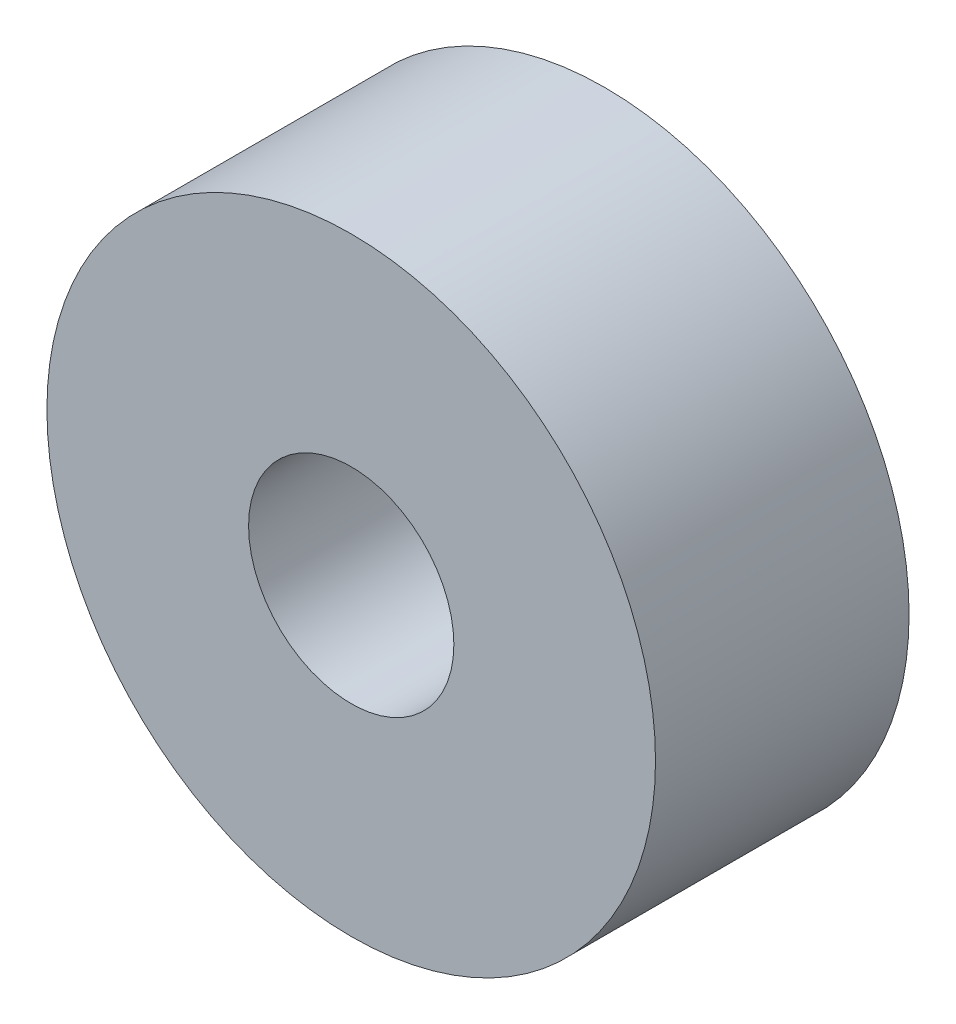
ISO-10303-21;
HEADER;
FILE_DESCRIPTION(('STEP AP214'),'2;1');
FILE_NAME('part.step','',(''),(''),'','','');
FILE_SCHEMA(('AUTOMOTIVE_DESIGN { 1 0 10303 214 1 1 1 1 }'));
ENDSEC;
DATA;
#1=APPLICATION_CONTEXT('core data for automotive mechanical design processes');
#2=APPLICATION_PROTOCOL_DEFINITION('international standard','automotive_design',2000,#1);
#3=PRODUCT_CONTEXT('',#1,'mechanical');
#4=PRODUCT('Part','Part','',(#3));
#5=PRODUCT_RELATED_PRODUCT_CATEGORY('part','',(#4));
#6=PRODUCT_DEFINITION_FORMATION('','',#4);
#7=PRODUCT_DEFINITION_CONTEXT('part definition',#1,'design');
#8=PRODUCT_DEFINITION('design','',#6,#7);
#9=PRODUCT_DEFINITION_SHAPE('','',#8);
#10=(LENGTH_UNIT() NAMED_UNIT(*) SI_UNIT(.MILLI.,.METRE.));
#11=(NAMED_UNIT(*) PLANE_ANGLE_UNIT() SI_UNIT($,.RADIAN.));
#12=(NAMED_UNIT(*) SI_UNIT($,.STERADIAN.) SOLID_ANGLE_UNIT());
#13=UNCERTAINTY_MEASURE_WITH_UNIT(LENGTH_MEASURE(1.E-05),#10,'distance_accuracy_value','');
#14=(GEOMETRIC_REPRESENTATION_CONTEXT(3) GLOBAL_UNCERTAINTY_ASSIGNED_CONTEXT((#13)) GLOBAL_UNIT_ASSIGNED_CONTEXT((#10,
#11,#12)) REPRESENTATION_CONTEXT('',''));
#15=CARTESIAN_POINT('',(0.,0.,0.));
#16=DIRECTION('',(0.,0.,1.));
#17=DIRECTION('',(1.,0.,0.));
#18=AXIS2_PLACEMENT_3D('',#15,#16,#17);
#19=CARTESIAN_POINT('',(0.,0.,3.96875));
#20=DIRECTION('',(0.,0.,1.));
#21=DIRECTION('',(1.,0.,0.));
#22=AXIS2_PLACEMENT_3D('',#19,#20,#21);
#23=PLANE('',#22);
#24=CARTESIAN_POINT('',(0.,0.,3.96875));
#25=DIRECTION('',(0.,0.,1.));
#26=DIRECTION('',(1.,0.,0.));
#27=AXIS2_PLACEMENT_3D('',#24,#25,#26);
#28=CIRCLE('',#27,4.7625);
#29=CARTESIAN_POINT('',(4.7625,0.,3.96875));
#30=VERTEX_POINT('',#29);
#31=EDGE_CURVE('E10',#30,#30,#28,.T.);
#32=ORIENTED_EDGE('',*,*,#31,.T.);
#33=EDGE_LOOP('',(#32));
#34=FACE_BOUND('',#33,.T.);
#35=CARTESIAN_POINT('',(0.,0.,3.96875));
#36=DIRECTION('',(0.,0.,1.));
#37=DIRECTION('',(1.,0.,0.));
#38=AXIS2_PLACEMENT_3D('',#35,#36,#37);
#39=CIRCLE('',#38,1.60655);
#40=CARTESIAN_POINT('',(1.60655,0.,3.96875));
#41=VERTEX_POINT('',#40);
#42=EDGE_CURVE('E49',#41,#41,#39,.T.);
#43=ORIENTED_EDGE('',*,*,#42,.F.);
#44=EDGE_LOOP('',(#43));
#45=FACE_BOUND('',#44,.T.);
#46=ADVANCED_FACE('F36',(#34,#45),#23,.T.);
#47=CARTESIAN_POINT('',(0.,0.,0.));
#48=DIRECTION('',(0.,0.,1.));
#49=DIRECTION('',(1.,0.,0.));
#50=AXIS2_PLACEMENT_3D('',#47,#48,#49);
#51=PLANE('',#50);
#52=CARTESIAN_POINT('',(0.,0.,0.));
#53=DIRECTION('',(0.,0.,1.));
#54=DIRECTION('',(1.,0.,0.));
#55=AXIS2_PLACEMENT_3D('',#52,#53,#54);
#56=CIRCLE('',#55,4.7625);
#57=CARTESIAN_POINT('',(4.7625,0.,0.));
#58=VERTEX_POINT('',#57);
#59=EDGE_CURVE('E40',#58,#58,#56,.T.);
#60=ORIENTED_EDGE('',*,*,#59,.F.);
#61=EDGE_LOOP('',(#60));
#62=FACE_BOUND('',#61,.T.);
#63=CARTESIAN_POINT('',(0.,0.,0.));
#64=DIRECTION('',(0.,0.,1.));
#65=DIRECTION('',(1.,0.,0.));
#66=AXIS2_PLACEMENT_3D('',#63,#64,#65);
#67=CIRCLE('',#66,1.60655);
#68=CARTESIAN_POINT('',(1.60655,0.,0.));
#69=VERTEX_POINT('',#68);
#70=EDGE_CURVE('E51',#69,#69,#67,.T.);
#71=ORIENTED_EDGE('',*,*,#70,.T.);
#72=EDGE_LOOP('',(#71));
#73=FACE_BOUND('',#72,.T.);
#74=ADVANCED_FACE('F63',(#62,#73),#51,.F.);
#75=CARTESIAN_POINT('',(0.,0.,3.96875));
#76=DIRECTION('',(0.,0.,-1.));
#77=DIRECTION('',(-1.,0.,0.));
#78=AXIS2_PLACEMENT_3D('',#75,#76,#77);
#79=CYLINDRICAL_SURFACE('',#78,4.7625);
#80=ORIENTED_EDGE('',*,*,#31,.F.);
#81=EDGE_LOOP('',(#80));
#82=FACE_BOUND('',#81,.T.);
#83=ORIENTED_EDGE('',*,*,#59,.T.);
#84=EDGE_LOOP('',(#83));
#85=FACE_BOUND('',#84,.T.);
#86=ADVANCED_FACE('F38',(#82,#85),#79,.T.);
#87=CARTESIAN_POINT('',(0.,0.,3.96875));
#88=DIRECTION('',(0.,0.,-1.));
#89=DIRECTION('',(-1.,0.,0.));
#90=AXIS2_PLACEMENT_3D('',#87,#88,#89);
#91=CYLINDRICAL_SURFACE('',#90,1.60655);
#92=ORIENTED_EDGE('',*,*,#42,.T.);
#93=EDGE_LOOP('',(#92));
#94=FACE_BOUND('',#93,.T.);
#95=ORIENTED_EDGE('',*,*,#70,.F.);
#96=EDGE_LOOP('',(#95));
#97=FACE_BOUND('',#96,.T.);
#98=ADVANCED_FACE('F59',(#94,#97),#91,.F.);
#99=CLOSED_SHELL('',(#46,#74,#86,#98));
#100=MANIFOLD_SOLID_BREP('B2',#99);
#101=ADVANCED_BREP_SHAPE_REPRESENTATION('',(#18,#100),#14);
#102=SHAPE_DEFINITION_REPRESENTATION(#9,#101);
ENDSEC;
END-ISO-10303-21;
